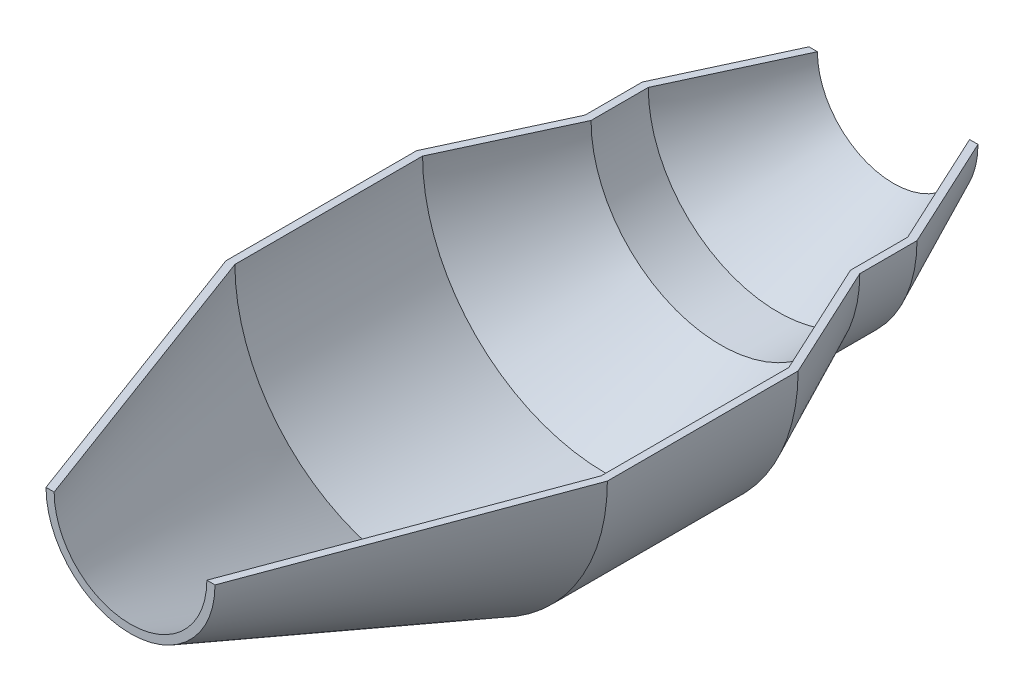
ISO-10303-21;
HEADER;
FILE_DESCRIPTION(('STEP AP214'),'2;1');
FILE_NAME('part.step','',(''),(''),'','','');
FILE_SCHEMA(('AUTOMOTIVE_DESIGN { 1 0 10303 214 1 1 1 1 }'));
ENDSEC;
DATA;
#1=APPLICATION_CONTEXT('core data for automotive mechanical design processes');
#2=APPLICATION_PROTOCOL_DEFINITION('international standard','automotive_design',2000,#1);
#3=PRODUCT_CONTEXT('',#1,'mechanical');
#4=PRODUCT('Part','Part','',(#3));
#5=PRODUCT_RELATED_PRODUCT_CATEGORY('part','',(#4));
#6=PRODUCT_DEFINITION_FORMATION('','',#4);
#7=PRODUCT_DEFINITION_CONTEXT('part definition',#1,'design');
#8=PRODUCT_DEFINITION('design','',#6,#7);
#9=PRODUCT_DEFINITION_SHAPE('','',#8);
#10=(LENGTH_UNIT() NAMED_UNIT(*) SI_UNIT(.MILLI.,.METRE.));
#11=(NAMED_UNIT(*) PLANE_ANGLE_UNIT() SI_UNIT($,.RADIAN.));
#12=(NAMED_UNIT(*) SI_UNIT($,.STERADIAN.) SOLID_ANGLE_UNIT());
#13=UNCERTAINTY_MEASURE_WITH_UNIT(LENGTH_MEASURE(1.E-05),#10,'distance_accuracy_value','');
#14=(GEOMETRIC_REPRESENTATION_CONTEXT(3) GLOBAL_UNCERTAINTY_ASSIGNED_CONTEXT((#13)) GLOBAL_UNIT_ASSIGNED_CONTEXT((#10,
#11,#12)) REPRESENTATION_CONTEXT('',''));
#15=CARTESIAN_POINT('',(0.,0.,0.));
#16=DIRECTION('',(0.,0.,1.));
#17=DIRECTION('',(1.,0.,0.));
#18=AXIS2_PLACEMENT_3D('',#15,#16,#17);
#19=CARTESIAN_POINT('',(-20.0165629191894,0.,100.));
#20=DIRECTION('',(0.,0.,1.));
#21=DIRECTION('',(1.,0.,0.));
#22=AXIS2_PLACEMENT_3D('',#19,#20,#21);
#23=PLANE('',#22);
#24=CARTESIAN_POINT('',(0.,0.,100.));
#25=DIRECTION('',(0.,0.,1.));
#26=DIRECTION('',(1.,0.,0.));
#27=AXIS2_PLACEMENT_3D('',#24,#25,#26);
#28=CIRCLE('',#27,22.15);
#29=CARTESIAN_POINT('',(-22.15,0.,100.));
#30=VERTEX_POINT('',#29);
#31=CARTESIAN_POINT('',(22.15,0.,100.));
#32=VERTEX_POINT('',#31);
#33=EDGE_CURVE('E11',#30,#32,#28,.T.);
#34=ORIENTED_EDGE('',*,*,#33,.T.);
#35=DIRECTION('',(1.,0.,0.));
#36=VECTOR('',#35,1.);
#37=CARTESIAN_POINT('',(20.0165629191894,0.,100.));
#38=LINE('',#37,#36);
#39=CARTESIAN_POINT('',(20.0165629191894,0.,100.));
#40=VERTEX_POINT('',#39);
#41=EDGE_CURVE('E121',#40,#32,#38,.T.);
#42=ORIENTED_EDGE('',*,*,#41,.F.);
#43=CARTESIAN_POINT('',(0.,0.,100.));
#44=DIRECTION('',(0.,0.,1.));
#45=DIRECTION('',(1.,0.,0.));
#46=AXIS2_PLACEMENT_3D('',#43,#44,#45);
#47=CIRCLE('',#46,20.0165629191894);
#48=CARTESIAN_POINT('',(-20.0165629191894,0.,100.));
#49=VERTEX_POINT('',#48);
#50=EDGE_CURVE('E48',#49,#40,#47,.T.);
#51=ORIENTED_EDGE('',*,*,#50,.F.);
#52=DIRECTION('',(-1.,0.,0.));
#53=VECTOR('',#52,1.);
#54=CARTESIAN_POINT('',(-20.0165629191894,0.,100.));
#55=LINE('',#54,#53);
#56=EDGE_CURVE('E123',#49,#30,#55,.T.);
#57=ORIENTED_EDGE('',*,*,#56,.T.);
#58=EDGE_LOOP('',(#34,#42,#51,#57));
#59=FACE_BOUND('',#58,.T.);
#60=ADVANCED_FACE('F33',(#59),#23,.T.);
#61=CARTESIAN_POINT('',(0.,0.,100.));
#62=DIRECTION('',(0.,0.,-1.));
#63=DIRECTION('',(-1.,0.,0.));
#64=AXIS2_PLACEMENT_3D('',#61,#62,#63);
#65=CONICAL_SURFACE('',#64,22.15,0.355552189685867);
#66=CARTESIAN_POINT('',(0.,0.,25.));
#67=DIRECTION('',(0.,0.,1.));
#68=DIRECTION('',(1.,0.,0.));
#69=AXIS2_PLACEMENT_3D('',#66,#67,#68);
#70=CIRCLE('',#69,50.);
#71=CARTESIAN_POINT('',(-50.,1.74574066942157E-13,25.));
#72=VERTEX_POINT('',#71);
#73=CARTESIAN_POINT('',(50.,1.74574066942157E-13,25.));
#74=VERTEX_POINT('',#73);
#75=EDGE_CURVE('E41',#72,#74,#70,.T.);
#76=ORIENTED_EDGE('',*,*,#75,.T.);
#77=DIRECTION('',(0.3481080709371,0.,-0.937454410064005));
#78=VECTOR('',#77,1.);
#79=CARTESIAN_POINT('',(22.15,0.,100.));
#80=LINE('',#79,#78);
#81=EDGE_CURVE('E132',#32,#74,#80,.T.);
#82=ORIENTED_EDGE('',*,*,#81,.F.);
#83=ORIENTED_EDGE('',*,*,#33,.F.);
#84=DIRECTION('',(-0.3481080709371,0.,-0.937454410064005));
#85=VECTOR('',#84,1.);
#86=CARTESIAN_POINT('',(-22.15,0.,100.));
#87=LINE('',#86,#85);
#88=EDGE_CURVE('E166',#30,#72,#87,.T.);
#89=ORIENTED_EDGE('',*,*,#88,.T.);
#90=EDGE_LOOP('',(#76,#82,#83,#89));
#91=FACE_BOUND('',#90,.T.);
#92=ADVANCED_FACE('F35',(#91),#65,.T.);
#93=CARTESIAN_POINT('',(0.,0.,100.));
#94=DIRECTION('',(0.,0.,1.));
#95=DIRECTION('',(1.,0.,0.));
#96=AXIS2_PLACEMENT_3D('',#93,#94,#95);
#97=CYLINDRICAL_SURFACE('',#96,50.);
#98=CARTESIAN_POINT('',(0.,0.,-25.));
#99=DIRECTION('',(0.,0.,1.));
#100=DIRECTION('',(1.,0.,0.));
#101=AXIS2_PLACEMENT_3D('',#98,#99,#100);
#102=CIRCLE('',#101,50.);
#103=CARTESIAN_POINT('',(-50.,1.74574066942157E-13,-25.));
#104=VERTEX_POINT('',#103);
#105=CARTESIAN_POINT('',(50.,1.74574066942157E-13,-25.));
#106=VERTEX_POINT('',#105);
#107=EDGE_CURVE('E212',#104,#106,#102,.T.);
#108=ORIENTED_EDGE('',*,*,#107,.T.);
#109=DIRECTION('',(0.,0.,-1.));
#110=VECTOR('',#109,1.);
#111=CARTESIAN_POINT('',(50.,1.74574066942157E-13,25.));
#112=LINE('',#111,#110);
#113=EDGE_CURVE('E137',#74,#106,#112,.T.);
#114=ORIENTED_EDGE('',*,*,#113,.F.);
#115=ORIENTED_EDGE('',*,*,#75,.F.);
#116=DIRECTION('',(0.,0.,-1.));
#117=VECTOR('',#116,1.);
#118=CARTESIAN_POINT('',(-50.,1.74574066942157E-13,25.));
#119=LINE('',#118,#117);
#120=EDGE_CURVE('E168',#72,#104,#119,.T.);
#121=ORIENTED_EDGE('',*,*,#120,.T.);
#122=EDGE_LOOP('',(#108,#114,#115,#121));
#123=FACE_BOUND('',#122,.T.);
#124=ADVANCED_FACE('F214',(#123),#97,.T.);
#125=CARTESIAN_POINT('',(0.,0.,-25.));
#126=DIRECTION('',(0.,0.,1.));
#127=DIRECTION('',(1.,0.,0.));
#128=AXIS2_PLACEMENT_3D('',#125,#126,#127);
#129=CONICAL_SURFACE('',#128,50.,0.434572274354768);
#130=CARTESIAN_POINT('',(0.,0.,-55.1615798922801));
#131=DIRECTION('',(0.,0.,1.));
#132=DIRECTION('',(1.,0.,0.));
#133=AXIS2_PLACEMENT_3D('',#130,#131,#132);
#134=CIRCLE('',#133,36.);
#135=CARTESIAN_POINT('',(-36.,1.25693328198353E-13,-55.1615798922801));
#136=VERTEX_POINT('',#135);
#137=CARTESIAN_POINT('',(36.,1.25693328198353E-13,-55.1615798922801));
#138=VERTEX_POINT('',#137);
#139=EDGE_CURVE('E210',#136,#138,#134,.T.);
#140=ORIENTED_EDGE('',*,*,#139,.T.);
#141=DIRECTION('',(-0.421022471256139,0.,-0.907050207374087));
#142=VECTOR('',#141,1.);
#143=CARTESIAN_POINT('',(50.,1.74574066942157E-13,-25.));
#144=LINE('',#143,#142);
#145=EDGE_CURVE('E139',#106,#138,#144,.T.);
#146=ORIENTED_EDGE('',*,*,#145,.F.);
#147=ORIENTED_EDGE('',*,*,#107,.F.);
#148=DIRECTION('',(0.421022471256139,0.,-0.907050207374087));
#149=VECTOR('',#148,1.);
#150=CARTESIAN_POINT('',(-50.,1.74574066942157E-13,-25.));
#151=LINE('',#150,#149);
#152=EDGE_CURVE('E171',#104,#136,#151,.T.);
#153=ORIENTED_EDGE('',*,*,#152,.T.);
#154=EDGE_LOOP('',(#140,#146,#147,#153));
#155=FACE_BOUND('',#154,.T.);
#156=ADVANCED_FACE('F220',(#155),#129,.T.);
#157=CARTESIAN_POINT('',(0.,0.,100.));
#158=DIRECTION('',(0.,0.,1.));
#159=DIRECTION('',(1.,0.,0.));
#160=AXIS2_PLACEMENT_3D('',#157,#158,#159);
#161=CYLINDRICAL_SURFACE('',#160,36.);
#162=CARTESIAN_POINT('',(0.,0.,-70.1615798922801));
#163=DIRECTION('',(0.,0.,1.));
#164=DIRECTION('',(1.,0.,0.));
#165=AXIS2_PLACEMENT_3D('',#162,#163,#164);
#166=CIRCLE('',#165,36.);
#167=CARTESIAN_POINT('',(-36.,1.25693328198353E-13,-70.1615798922801));
#168=VERTEX_POINT('',#167);
#169=CARTESIAN_POINT('',(36.,1.25693328198353E-13,-70.1615798922801));
#170=VERTEX_POINT('',#169);
#171=EDGE_CURVE('E208',#168,#170,#166,.T.);
#172=ORIENTED_EDGE('',*,*,#171,.T.);
#173=DIRECTION('',(0.,0.,-1.));
#174=VECTOR('',#173,1.);
#175=CARTESIAN_POINT('',(36.,1.25693328198353E-13,-55.1615798922801));
#176=LINE('',#175,#174);
#177=EDGE_CURVE('E144',#138,#170,#176,.T.);
#178=ORIENTED_EDGE('',*,*,#177,.F.);
#179=ORIENTED_EDGE('',*,*,#139,.F.);
#180=DIRECTION('',(0.,0.,-1.));
#181=VECTOR('',#180,1.);
#182=CARTESIAN_POINT('',(-36.,1.25693328198353E-13,-55.1615798922801));
#183=LINE('',#182,#181);
#184=EDGE_CURVE('E174',#136,#168,#183,.T.);
#185=ORIENTED_EDGE('',*,*,#184,.T.);
#186=EDGE_LOOP('',(#172,#178,#179,#185));
#187=FACE_BOUND('',#186,.T.);
#188=ADVANCED_FACE('F223',(#187),#161,.T.);
#189=CARTESIAN_POINT('',(0.,0.,-70.1615798922801));
#190=DIRECTION('',(0.,0.,1.));
#191=DIRECTION('',(1.,0.,0.));
#192=AXIS2_PLACEMENT_3D('',#189,#190,#191);
#193=CONICAL_SURFACE('',#192,36.,0.434572274354768);
#194=CARTESIAN_POINT('',(0.,0.,-100.));
#195=DIRECTION('',(0.,0.,1.));
#196=DIRECTION('',(1.,0.,0.));
#197=AXIS2_PLACEMENT_3D('',#194,#195,#196);
#198=CIRCLE('',#197,22.15);
#199=CARTESIAN_POINT('',(-22.15,0.,-100.));
#200=VERTEX_POINT('',#199);
#201=CARTESIAN_POINT('',(22.15,0.,-100.));
#202=VERTEX_POINT('',#201);
#203=EDGE_CURVE('E206',#200,#202,#198,.T.);
#204=ORIENTED_EDGE('',*,*,#203,.T.);
#205=DIRECTION('',(-0.421022471256139,0.,-0.907050207374087));
#206=VECTOR('',#205,1.);
#207=CARTESIAN_POINT('',(36.,1.25693328198353E-13,-70.1615798922801));
#208=LINE('',#207,#206);
#209=EDGE_CURVE('E147',#170,#202,#208,.T.);
#210=ORIENTED_EDGE('',*,*,#209,.F.);
#211=ORIENTED_EDGE('',*,*,#171,.F.);
#212=DIRECTION('',(0.421022471256139,0.,-0.907050207374087));
#213=VECTOR('',#212,1.);
#214=CARTESIAN_POINT('',(-36.,1.25693328198353E-13,-70.1615798922801));
#215=LINE('',#214,#213);
#216=EDGE_CURVE('E177',#168,#200,#215,.T.);
#217=ORIENTED_EDGE('',*,*,#216,.T.);
#218=EDGE_LOOP('',(#204,#210,#211,#217));
#219=FACE_BOUND('',#218,.T.);
#220=ADVANCED_FACE('F228',(#219),#193,.T.);
#221=CARTESIAN_POINT('',(-19.9450503911024,0.,-100.));
#222=DIRECTION('',(0.,0.,-1.));
#223=DIRECTION('',(-1.,0.,0.));
#224=AXIS2_PLACEMENT_3D('',#221,#222,#223);
#225=PLANE('',#224);
#226=CARTESIAN_POINT('',(0.,0.,-100.));
#227=DIRECTION('',(0.,0.,1.));
#228=DIRECTION('',(1.,0.,0.));
#229=AXIS2_PLACEMENT_3D('',#226,#227,#228);
#230=CIRCLE('',#229,19.9450503911024);
#231=CARTESIAN_POINT('',(-19.9450503911024,0.,-100.));
#232=VERTEX_POINT('',#231);
#233=CARTESIAN_POINT('',(19.9450503911024,0.,-100.));
#234=VERTEX_POINT('',#233);
#235=EDGE_CURVE('E204',#232,#234,#230,.T.);
#236=ORIENTED_EDGE('',*,*,#235,.T.);
#237=DIRECTION('',(-1.,0.,0.));
#238=VECTOR('',#237,1.);
#239=CARTESIAN_POINT('',(19.9450503911024,0.,-100.));
#240=LINE('',#239,#238);
#241=EDGE_CURVE('E150',#202,#234,#240,.T.);
#242=ORIENTED_EDGE('',*,*,#241,.F.);
#243=ORIENTED_EDGE('',*,*,#203,.F.);
#244=DIRECTION('',(1.,0.,0.));
#245=VECTOR('',#244,1.);
#246=CARTESIAN_POINT('',(-19.9450503911024,0.,-100.));
#247=LINE('',#246,#245);
#248=EDGE_CURVE('E180',#200,#232,#247,.T.);
#249=ORIENTED_EDGE('',*,*,#248,.T.);
#250=EDGE_LOOP('',(#236,#242,#243,#249));
#251=FACE_BOUND('',#250,.T.);
#252=ADVANCED_FACE('F231',(#251),#225,.T.);
#253=CARTESIAN_POINT('',(0.,0.,-100.));
#254=DIRECTION('',(0.,0.,1.));
#255=DIRECTION('',(1.,0.,0.));
#256=AXIS2_PLACEMENT_3D('',#253,#254,#255);
#257=CONICAL_SURFACE('',#256,19.9450503911024,0.434572274354769);
#258=CARTESIAN_POINT('',(0.,0.,-69.7200367492331));
#259=DIRECTION('',(0.,0.,1.));
#260=DIRECTION('',(1.,0.,0.));
#261=AXIS2_PLACEMENT_3D('',#258,#259,#260);
#262=CIRCLE('',#261,34.);
#263=CARTESIAN_POINT('',(-34.,1.18710365520667E-13,-69.7200367492331));
#264=VERTEX_POINT('',#263);
#265=CARTESIAN_POINT('',(34.,1.18710365520667E-13,-69.7200367492331));
#266=VERTEX_POINT('',#265);
#267=EDGE_CURVE('E202',#264,#266,#262,.T.);
#268=ORIENTED_EDGE('',*,*,#267,.T.);
#269=DIRECTION('',(0.421022471256139,0.,0.907050207374087));
#270=VECTOR('',#269,1.);
#271=CARTESIAN_POINT('',(34.,1.18710365520667E-13,-69.7200367492331));
#272=LINE('',#271,#270);
#273=EDGE_CURVE('E153',#234,#266,#272,.T.);
#274=ORIENTED_EDGE('',*,*,#273,.F.);
#275=ORIENTED_EDGE('',*,*,#235,.F.);
#276=DIRECTION('',(-0.421022471256139,0.,0.907050207374087));
#277=VECTOR('',#276,1.);
#278=CARTESIAN_POINT('',(-34.,1.18710365520667E-13,-69.7200367492331));
#279=LINE('',#278,#277);
#280=EDGE_CURVE('E183',#232,#264,#279,.T.);
#281=ORIENTED_EDGE('',*,*,#280,.T.);
#282=EDGE_LOOP('',(#268,#274,#275,#281));
#283=FACE_BOUND('',#282,.T.);
#284=ADVANCED_FACE('F236',(#283),#257,.F.);
#285=CARTESIAN_POINT('',(0.,0.,100.));
#286=DIRECTION('',(0.,0.,1.));
#287=DIRECTION('',(1.,0.,0.));
#288=AXIS2_PLACEMENT_3D('',#285,#286,#287);
#289=CYLINDRICAL_SURFACE('',#288,34.);
#290=CARTESIAN_POINT('',(0.,0.,-54.7200367492331));
#291=DIRECTION('',(0.,0.,1.));
#292=DIRECTION('',(1.,0.,0.));
#293=AXIS2_PLACEMENT_3D('',#290,#291,#292);
#294=CIRCLE('',#293,34.);
#295=CARTESIAN_POINT('',(-34.,1.18710365520667E-13,-54.7200367492331));
#296=VERTEX_POINT('',#295);
#297=CARTESIAN_POINT('',(34.,1.18710365520667E-13,-54.7200367492331));
#298=VERTEX_POINT('',#297);
#299=EDGE_CURVE('E200',#296,#298,#294,.T.);
#300=ORIENTED_EDGE('',*,*,#299,.T.);
#301=DIRECTION('',(0.,0.,1.));
#302=VECTOR('',#301,1.);
#303=CARTESIAN_POINT('',(34.,1.18710365520667E-13,-54.7200367492331));
#304=LINE('',#303,#302);
#305=EDGE_CURVE('E156',#266,#298,#304,.T.);
#306=ORIENTED_EDGE('',*,*,#305,.F.);
#307=ORIENTED_EDGE('',*,*,#267,.F.);
#308=DIRECTION('',(0.,0.,1.));
#309=VECTOR('',#308,1.);
#310=CARTESIAN_POINT('',(-34.,1.18710365520667E-13,-54.7200367492331));
#311=LINE('',#310,#309);
#312=EDGE_CURVE('E186',#264,#296,#311,.T.);
#313=ORIENTED_EDGE('',*,*,#312,.T.);
#314=EDGE_LOOP('',(#300,#306,#307,#313));
#315=FACE_BOUND('',#314,.T.);
#316=ADVANCED_FACE('F239',(#315),#289,.F.);
#317=CARTESIAN_POINT('',(0.,0.,-54.7200367492331));
#318=DIRECTION('',(0.,0.,1.));
#319=DIRECTION('',(1.,0.,0.));
#320=AXIS2_PLACEMENT_3D('',#317,#318,#319);
#321=CONICAL_SURFACE('',#320,34.,0.434572274354769);
#322=CARTESIAN_POINT('',(0.,0.,-24.5584568569531));
#323=DIRECTION('',(0.,0.,1.));
#324=DIRECTION('',(1.,0.,0.));
#325=AXIS2_PLACEMENT_3D('',#322,#323,#324);
#326=CIRCLE('',#325,48.);
#327=CARTESIAN_POINT('',(-48.,1.67591104264471E-13,-24.5584568569531));
#328=VERTEX_POINT('',#327);
#329=CARTESIAN_POINT('',(48.,1.67591104264471E-13,-24.5584568569531));
#330=VERTEX_POINT('',#329);
#331=EDGE_CURVE('E198',#328,#330,#326,.T.);
#332=ORIENTED_EDGE('',*,*,#331,.T.);
#333=DIRECTION('',(0.421022471256139,0.,0.907050207374087));
#334=VECTOR('',#333,1.);
#335=CARTESIAN_POINT('',(48.,1.67591104264471E-13,-24.5584568569531));
#336=LINE('',#335,#334);
#337=EDGE_CURVE('E159',#298,#330,#336,.T.);
#338=ORIENTED_EDGE('',*,*,#337,.F.);
#339=ORIENTED_EDGE('',*,*,#299,.F.);
#340=DIRECTION('',(-0.421022471256139,0.,0.907050207374087));
#341=VECTOR('',#340,1.);
#342=CARTESIAN_POINT('',(-48.,1.67591104264471E-13,-24.5584568569531));
#343=LINE('',#342,#341);
#344=EDGE_CURVE('E189',#296,#328,#343,.T.);
#345=ORIENTED_EDGE('',*,*,#344,.T.);
#346=EDGE_LOOP('',(#332,#338,#339,#345));
#347=FACE_BOUND('',#346,.T.);
#348=ADVANCED_FACE('F244',(#347),#321,.F.);
#349=CARTESIAN_POINT('',(0.,0.,100.));
#350=DIRECTION('',(0.,0.,1.));
#351=DIRECTION('',(1.,0.,0.));
#352=AXIS2_PLACEMENT_3D('',#349,#350,#351);
#353=CYLINDRICAL_SURFACE('',#352,48.);
#354=CARTESIAN_POINT('',(0.,0.,24.6406541809409));
#355=DIRECTION('',(0.,0.,1.));
#356=DIRECTION('',(1.,0.,0.));
#357=AXIS2_PLACEMENT_3D('',#354,#355,#356);
#358=CIRCLE('',#357,48.);
#359=CARTESIAN_POINT('',(-48.,1.67591104264471E-13,24.6406541809409));
#360=VERTEX_POINT('',#359);
#361=CARTESIAN_POINT('',(48.,1.67591104264471E-13,24.6406541809409));
#362=VERTEX_POINT('',#361);
#363=EDGE_CURVE('E56',#360,#362,#358,.T.);
#364=ORIENTED_EDGE('',*,*,#363,.T.);
#365=DIRECTION('',(0.,0.,1.));
#366=VECTOR('',#365,1.);
#367=CARTESIAN_POINT('',(48.,1.67591104264471E-13,24.6406541809409));
#368=LINE('',#367,#366);
#369=EDGE_CURVE('E162',#330,#362,#368,.T.);
#370=ORIENTED_EDGE('',*,*,#369,.F.);
#371=ORIENTED_EDGE('',*,*,#331,.F.);
#372=DIRECTION('',(0.,0.,1.));
#373=VECTOR('',#372,1.);
#374=CARTESIAN_POINT('',(-48.,1.67591104264471E-13,24.6406541809409));
#375=LINE('',#374,#373);
#376=EDGE_CURVE('E192',#328,#360,#375,.T.);
#377=ORIENTED_EDGE('',*,*,#376,.T.);
#378=EDGE_LOOP('',(#364,#370,#371,#377));
#379=FACE_BOUND('',#378,.T.);
#380=ADVANCED_FACE('F247',(#379),#353,.F.);
#381=CARTESIAN_POINT('',(0.,0.,24.6406541809409));
#382=DIRECTION('',(0.,0.,-1.));
#383=DIRECTION('',(-1.,0.,0.));
#384=AXIS2_PLACEMENT_3D('',#381,#382,#383);
#385=CONICAL_SURFACE('',#384,48.,0.355552189685867);
#386=DIRECTION('',(0.3481080709371,0.,0.937454410064004));
#387=VECTOR('',#386,1.);
#388=CARTESIAN_POINT('',(-20.0165629191894,0.,100.));
#389=LINE('',#388,#387);
#390=EDGE_CURVE('E194',#360,#49,#389,.T.);
#391=ORIENTED_EDGE('',*,*,#390,.T.);
#392=ORIENTED_EDGE('',*,*,#50,.T.);
#393=DIRECTION('',(-0.3481080709371,0.,0.937454410064004));
#394=VECTOR('',#393,1.);
#395=CARTESIAN_POINT('',(20.0165629191894,0.,100.));
#396=LINE('',#395,#394);
#397=EDGE_CURVE('E135',#362,#40,#396,.T.);
#398=ORIENTED_EDGE('',*,*,#397,.F.);
#399=ORIENTED_EDGE('',*,*,#363,.F.);
#400=EDGE_LOOP('',(#391,#392,#398,#399));
#401=FACE_BOUND('',#400,.T.);
#402=ADVANCED_FACE('F249',(#401),#385,.F.);
#403=CARTESIAN_POINT('',(0.,0.,0.));
#404=DIRECTION('',(0.,-1.,0.));
#405=DIRECTION('',(0.,0.,-1.));
#406=AXIS2_PLACEMENT_3D('',#403,#404,#405);
#407=PLANE('',#406);
#408=ORIENTED_EDGE('',*,*,#56,.F.);
#409=ORIENTED_EDGE('',*,*,#390,.F.);
#410=ORIENTED_EDGE('',*,*,#376,.F.);
#411=ORIENTED_EDGE('',*,*,#344,.F.);
#412=ORIENTED_EDGE('',*,*,#312,.F.);
#413=ORIENTED_EDGE('',*,*,#280,.F.);
#414=ORIENTED_EDGE('',*,*,#248,.F.);
#415=ORIENTED_EDGE('',*,*,#216,.F.);
#416=ORIENTED_EDGE('',*,*,#184,.F.);
#417=ORIENTED_EDGE('',*,*,#152,.F.);
#418=ORIENTED_EDGE('',*,*,#120,.F.);
#419=ORIENTED_EDGE('',*,*,#88,.F.);
#420=EDGE_LOOP('',(#408,#409,#410,#411,#412,#413,#414,#415,#416,#417,#418,#419));
#421=FACE_BOUND('',#420,.T.);
#422=ADVANCED_FACE('F251',(#421),#407,.F.);
#423=CARTESIAN_POINT('',(0.,0.,0.));
#424=DIRECTION('',(0.,1.,0.));
#425=DIRECTION('',(0.,0.,-1.));
#426=AXIS2_PLACEMENT_3D('',#423,#424,#425);
#427=PLANE('',#426);
#428=ORIENTED_EDGE('',*,*,#41,.T.);
#429=ORIENTED_EDGE('',*,*,#81,.T.);
#430=ORIENTED_EDGE('',*,*,#113,.T.);
#431=ORIENTED_EDGE('',*,*,#145,.T.);
#432=ORIENTED_EDGE('',*,*,#177,.T.);
#433=ORIENTED_EDGE('',*,*,#209,.T.);
#434=ORIENTED_EDGE('',*,*,#241,.T.);
#435=ORIENTED_EDGE('',*,*,#273,.T.);
#436=ORIENTED_EDGE('',*,*,#305,.T.);
#437=ORIENTED_EDGE('',*,*,#337,.T.);
#438=ORIENTED_EDGE('',*,*,#369,.T.);
#439=ORIENTED_EDGE('',*,*,#397,.T.);
#440=EDGE_LOOP('',(#428,#429,#430,#431,#432,#433,#434,#435,#436,#437,#438,#439));
#441=FACE_BOUND('',#440,.T.);
#442=ADVANCED_FACE('F130',(#441),#427,.T.);
#443=CLOSED_SHELL('',(#60,#92,#124,#156,#188,#220,#252,#284,#316,#348,#380,#402,#422,#442));
#444=MANIFOLD_SOLID_BREP('B2',#443);
#445=ADVANCED_BREP_SHAPE_REPRESENTATION('',(#18,#444),#14);
#446=SHAPE_DEFINITION_REPRESENTATION(#9,#445);
ENDSEC;
END-ISO-10303-21;
